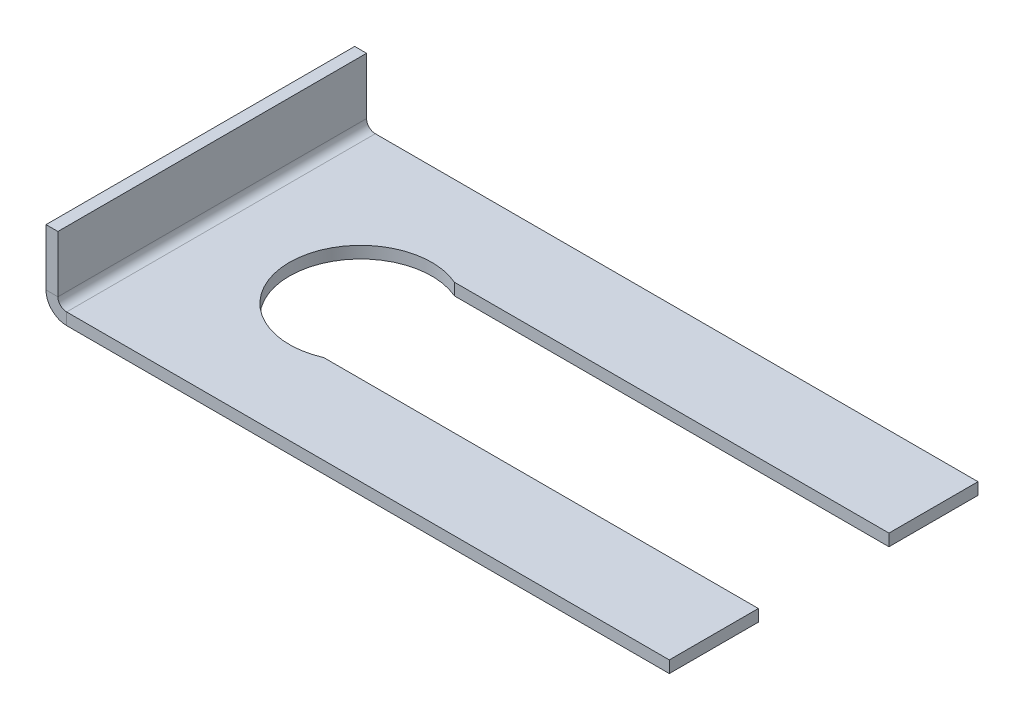
ISO-10303-21;
HEADER;
FILE_DESCRIPTION(('STEP AP214'),'2;1');
FILE_NAME('part.step','',(''),(''),'','','');
FILE_SCHEMA(('AUTOMOTIVE_DESIGN { 1 0 10303 214 1 1 1 1 }'));
ENDSEC;
DATA;
#1=APPLICATION_CONTEXT('core data for automotive mechanical design processes');
#2=APPLICATION_PROTOCOL_DEFINITION('international standard','automotive_design',2000,#1);
#3=PRODUCT_CONTEXT('',#1,'mechanical');
#4=PRODUCT('Part','Part','',(#3));
#5=PRODUCT_RELATED_PRODUCT_CATEGORY('part','',(#4));
#6=PRODUCT_DEFINITION_FORMATION('','',#4);
#7=PRODUCT_DEFINITION_CONTEXT('part definition',#1,'design');
#8=PRODUCT_DEFINITION('design','',#6,#7);
#9=PRODUCT_DEFINITION_SHAPE('','',#8);
#10=(LENGTH_UNIT() NAMED_UNIT(*) SI_UNIT(.MILLI.,.METRE.));
#11=(NAMED_UNIT(*) PLANE_ANGLE_UNIT() SI_UNIT($,.RADIAN.));
#12=(NAMED_UNIT(*) SI_UNIT($,.STERADIAN.) SOLID_ANGLE_UNIT());
#13=UNCERTAINTY_MEASURE_WITH_UNIT(LENGTH_MEASURE(1.E-05),#10,'distance_accuracy_value','');
#14=(GEOMETRIC_REPRESENTATION_CONTEXT(3) GLOBAL_UNCERTAINTY_ASSIGNED_CONTEXT((#13)) GLOBAL_UNIT_ASSIGNED_CONTEXT((#10,
#11,#12)) REPRESENTATION_CONTEXT('',''));
#15=CARTESIAN_POINT('',(0.,0.,0.));
#16=DIRECTION('',(0.,0.,1.));
#17=DIRECTION('',(1.,0.,0.));
#18=AXIS2_PLACEMENT_3D('',#15,#16,#17);
#19=CARTESIAN_POINT('',(-26.25,-1.,13.));
#20=DIRECTION('',(0.,0.,1.));
#21=DIRECTION('',(1.,0.,0.));
#22=AXIS2_PLACEMENT_3D('',#19,#20,#21);
#23=PLANE('',#22);
#24=DIRECTION('',(1.,0.,0.));
#25=VECTOR('',#24,1.);
#26=CARTESIAN_POINT('',(-26.25,0.,13.));
#27=LINE('',#26,#25);
#28=CARTESIAN_POINT('',(-24.5134,0.,13.));
#29=VERTEX_POINT('',#28);
#30=CARTESIAN_POINT('',(26.25,0.,13.));
#31=VERTEX_POINT('',#30);
#32=EDGE_CURVE('E176',#29,#31,#27,.T.);
#33=ORIENTED_EDGE('',*,*,#32,.F.);
#34=DIRECTION('',(0.,-1.,0.));
#35=VECTOR('',#34,1.);
#36=CARTESIAN_POINT('',(-24.5134,0.,13.));
#37=LINE('',#36,#35);
#38=CARTESIAN_POINT('',(-24.5134,-1.,13.));
#39=VERTEX_POINT('',#38);
#40=EDGE_CURVE('E242',#29,#39,#37,.T.);
#41=ORIENTED_EDGE('',*,*,#40,.T.);
#42=DIRECTION('',(1.,0.,0.));
#43=VECTOR('',#42,1.);
#44=CARTESIAN_POINT('',(-26.25,-1.,13.));
#45=LINE('',#44,#43);
#46=CARTESIAN_POINT('',(26.25,-1.,13.));
#47=VERTEX_POINT('',#46);
#48=EDGE_CURVE('E162',#39,#47,#45,.T.);
#49=ORIENTED_EDGE('',*,*,#48,.T.);
#50=DIRECTION('',(0.,1.,0.));
#51=VECTOR('',#50,1.);
#52=CARTESIAN_POINT('',(26.25,-1.,13.));
#53=LINE('',#52,#51);
#54=EDGE_CURVE('E196',#47,#31,#53,.T.);
#55=ORIENTED_EDGE('',*,*,#54,.T.);
#56=EDGE_LOOP('',(#33,#41,#49,#55));
#57=FACE_BOUND('',#56,.T.);
#58=ADVANCED_FACE('F64',(#57),#23,.T.);
#59=CARTESIAN_POINT('',(-12.75,-1.,0.));
#60=DIRECTION('',(0.,1.,0.));
#61=DIRECTION('',(0.,0.,1.));
#62=AXIS2_PLACEMENT_3D('',#59,#60,#61);
#63=PLANE('',#62);
#64=DIRECTION('',(0.,0.,1.));
#65=VECTOR('',#64,1.);
#66=CARTESIAN_POINT('',(-24.5134,-1.,13.));
#67=LINE('',#66,#65);
#68=CARTESIAN_POINT('',(-24.5134,-1.,-13.));
#69=VERTEX_POINT('',#68);
#70=EDGE_CURVE('E284',#39,#69,#67,.F.);
#71=ORIENTED_EDGE('',*,*,#70,.T.);
#72=DIRECTION('',(-1.,0.,0.));
#73=VECTOR('',#72,1.);
#74=CARTESIAN_POINT('',(-26.25,-1.,-13.));
#75=LINE('',#74,#73);
#76=CARTESIAN_POINT('',(26.25,-1.,-13.));
#77=VERTEX_POINT('',#76);
#78=EDGE_CURVE('E280',#77,#69,#75,.T.);
#79=ORIENTED_EDGE('',*,*,#78,.F.);
#80=DIRECTION('',(0.,0.,-1.));
#81=VECTOR('',#80,1.);
#82=CARTESIAN_POINT('',(26.25,-1.,-5.5));
#83=LINE('',#82,#81);
#84=CARTESIAN_POINT('',(26.25,-1.,-5.5));
#85=VERTEX_POINT('',#84);
#86=EDGE_CURVE('E191',#85,#77,#83,.T.);
#87=ORIENTED_EDGE('',*,*,#86,.F.);
#88=DIRECTION('',(1.,0.,0.));
#89=VECTOR('',#88,1.);
#90=CARTESIAN_POINT('',(-10.3520842383436,-1.,-5.5));
#91=LINE('',#90,#89);
#92=CARTESIAN_POINT('',(-10.3520842383436,-1.,-5.5));
#93=VERTEX_POINT('',#92);
#94=EDGE_CURVE('E154',#93,#85,#91,.T.);
#95=ORIENTED_EDGE('',*,*,#94,.F.);
#96=CARTESIAN_POINT('',(-12.75,-1.,0.));
#97=DIRECTION('',(0.,-1.,0.));
#98=DIRECTION('',(0.,0.,1.));
#99=AXIS2_PLACEMENT_3D('',#96,#97,#98);
#100=CIRCLE('',#99,6.);
#101=CARTESIAN_POINT('',(-10.3520842383436,-1.,5.5));
#102=VERTEX_POINT('',#101);
#103=EDGE_CURVE('E136',#102,#93,#100,.T.);
#104=ORIENTED_EDGE('',*,*,#103,.F.);
#105=DIRECTION('',(-1.,0.,0.));
#106=VECTOR('',#105,1.);
#107=CARTESIAN_POINT('',(-10.3520842383436,-1.,5.5));
#108=LINE('',#107,#106);
#109=CARTESIAN_POINT('',(26.25,-1.,5.5));
#110=VERTEX_POINT('',#109);
#111=EDGE_CURVE('E152',#110,#102,#108,.T.);
#112=ORIENTED_EDGE('',*,*,#111,.F.);
#113=DIRECTION('',(0.,0.,-1.));
#114=VECTOR('',#113,1.);
#115=CARTESIAN_POINT('',(26.25,-1.,13.));
#116=LINE('',#115,#114);
#117=EDGE_CURVE('E159',#47,#110,#116,.T.);
#118=ORIENTED_EDGE('',*,*,#117,.F.);
#119=ORIENTED_EDGE('',*,*,#48,.F.);
#120=EDGE_LOOP('',(#71,#79,#87,#95,#104,#112,#118,#119));
#121=FACE_BOUND('',#120,.T.);
#122=ADVANCED_FACE('F150',(#121),#63,.F.);
#123=CARTESIAN_POINT('',(-12.75,0.,0.));
#124=DIRECTION('',(0.,1.,0.));
#125=DIRECTION('',(0.,0.,1.));
#126=AXIS2_PLACEMENT_3D('',#123,#124,#125);
#127=PLANE('',#126);
#128=DIRECTION('',(-1.,0.,0.));
#129=VECTOR('',#128,1.);
#130=CARTESIAN_POINT('',(-26.25,0.,-13.));
#131=LINE('',#130,#129);
#132=CARTESIAN_POINT('',(26.25,0.,-13.));
#133=VERTEX_POINT('',#132);
#134=CARTESIAN_POINT('',(-24.5134,0.,-13.));
#135=VERTEX_POINT('',#134);
#136=EDGE_CURVE('E172',#133,#135,#131,.T.);
#137=ORIENTED_EDGE('',*,*,#136,.T.);
#138=DIRECTION('',(0.,0.,1.));
#139=VECTOR('',#138,1.);
#140=CARTESIAN_POINT('',(-24.5134,0.,13.));
#141=LINE('',#140,#139);
#142=EDGE_CURVE('E82',#29,#135,#141,.F.);
#143=ORIENTED_EDGE('',*,*,#142,.F.);
#144=ORIENTED_EDGE('',*,*,#32,.T.);
#145=DIRECTION('',(0.,0.,-1.));
#146=VECTOR('',#145,1.);
#147=CARTESIAN_POINT('',(26.25,0.,13.));
#148=LINE('',#147,#146);
#149=CARTESIAN_POINT('',(26.25,0.,5.5));
#150=VERTEX_POINT('',#149);
#151=EDGE_CURVE('E179',#31,#150,#148,.T.);
#152=ORIENTED_EDGE('',*,*,#151,.T.);
#153=DIRECTION('',(-1.,0.,0.));
#154=VECTOR('',#153,1.);
#155=CARTESIAN_POINT('',(-10.3520842383436,0.,5.5));
#156=LINE('',#155,#154);
#157=CARTESIAN_POINT('',(-10.3520842383436,0.,5.5));
#158=VERTEX_POINT('',#157);
#159=EDGE_CURVE('E183',#150,#158,#156,.T.);
#160=ORIENTED_EDGE('',*,*,#159,.T.);
#161=CARTESIAN_POINT('',(-12.75,0.,0.));
#162=DIRECTION('',(0.,-1.,0.));
#163=DIRECTION('',(0.,0.,1.));
#164=AXIS2_PLACEMENT_3D('',#161,#162,#163);
#165=CIRCLE('',#164,6.);
#166=CARTESIAN_POINT('',(-10.3520842383436,0.,-5.5));
#167=VERTEX_POINT('',#166);
#168=EDGE_CURVE('E139',#158,#167,#165,.T.);
#169=ORIENTED_EDGE('',*,*,#168,.T.);
#170=DIRECTION('',(1.,0.,0.));
#171=VECTOR('',#170,1.);
#172=CARTESIAN_POINT('',(-10.3520842383436,0.,-5.5));
#173=LINE('',#172,#171);
#174=CARTESIAN_POINT('',(26.25,0.,-5.5));
#175=VERTEX_POINT('',#174);
#176=EDGE_CURVE('E188',#167,#175,#173,.T.);
#177=ORIENTED_EDGE('',*,*,#176,.T.);
#178=DIRECTION('',(0.,0.,-1.));
#179=VECTOR('',#178,1.);
#180=CARTESIAN_POINT('',(26.25,0.,-5.5));
#181=LINE('',#180,#179);
#182=EDGE_CURVE('E168',#175,#133,#181,.T.);
#183=ORIENTED_EDGE('',*,*,#182,.T.);
#184=EDGE_LOOP('',(#137,#143,#144,#152,#160,#169,#177,#183));
#185=FACE_BOUND('',#184,.T.);
#186=ADVANCED_FACE('F207',(#185),#127,.T.);
#187=CARTESIAN_POINT('',(26.25,-1.,-5.5));
#188=DIRECTION('',(1.,0.,0.));
#189=DIRECTION('',(0.,0.,-1.));
#190=AXIS2_PLACEMENT_3D('',#187,#188,#189);
#191=PLANE('',#190);
#192=ORIENTED_EDGE('',*,*,#182,.F.);
#193=DIRECTION('',(0.,1.,0.));
#194=VECTOR('',#193,1.);
#195=CARTESIAN_POINT('',(26.25,-1.,-5.5));
#196=LINE('',#195,#194);
#197=EDGE_CURVE('E13',#85,#175,#196,.T.);
#198=ORIENTED_EDGE('',*,*,#197,.F.);
#199=ORIENTED_EDGE('',*,*,#86,.T.);
#200=DIRECTION('',(0.,1.,0.));
#201=VECTOR('',#200,1.);
#202=CARTESIAN_POINT('',(26.25,-1.,-13.));
#203=LINE('',#202,#201);
#204=EDGE_CURVE('E68',#77,#133,#203,.T.);
#205=ORIENTED_EDGE('',*,*,#204,.T.);
#206=EDGE_LOOP('',(#192,#198,#199,#205));
#207=FACE_BOUND('',#206,.T.);
#208=ADVANCED_FACE('F66',(#207),#191,.T.);
#209=CARTESIAN_POINT('',(-10.3520842383436,-1.,-5.5));
#210=DIRECTION('',(0.,0.,1.));
#211=DIRECTION('',(1.,0.,0.));
#212=AXIS2_PLACEMENT_3D('',#209,#210,#211);
#213=PLANE('',#212);
#214=ORIENTED_EDGE('',*,*,#176,.F.);
#215=DIRECTION('',(0.,1.,0.));
#216=VECTOR('',#215,1.);
#217=CARTESIAN_POINT('',(-10.3520842383436,-1.,-5.5));
#218=LINE('',#217,#216);
#219=EDGE_CURVE('E74',#93,#167,#218,.T.);
#220=ORIENTED_EDGE('',*,*,#219,.F.);
#221=ORIENTED_EDGE('',*,*,#94,.T.);
#222=ORIENTED_EDGE('',*,*,#197,.T.);
#223=EDGE_LOOP('',(#214,#220,#221,#222));
#224=FACE_BOUND('',#223,.T.);
#225=ADVANCED_FACE('F208',(#224),#213,.T.);
#226=CARTESIAN_POINT('',(-12.75,-1.,0.));
#227=DIRECTION('',(0.,1.,0.));
#228=DIRECTION('',(0.,0.,1.));
#229=AXIS2_PLACEMENT_3D('',#226,#227,#228);
#230=CYLINDRICAL_SURFACE('',#229,6.);
#231=ORIENTED_EDGE('',*,*,#168,.F.);
#232=DIRECTION('',(0.,1.,0.));
#233=VECTOR('',#232,1.);
#234=CARTESIAN_POINT('',(-10.3520842383436,-1.,5.5));
#235=LINE('',#234,#233);
#236=EDGE_CURVE('E133',#102,#158,#235,.T.);
#237=ORIENTED_EDGE('',*,*,#236,.F.);
#238=ORIENTED_EDGE('',*,*,#103,.T.);
#239=ORIENTED_EDGE('',*,*,#219,.T.);
#240=EDGE_LOOP('',(#231,#237,#238,#239));
#241=FACE_BOUND('',#240,.T.);
#242=ADVANCED_FACE('F135',(#241),#230,.F.);
#243=CARTESIAN_POINT('',(-10.3520842383436,-1.,5.5));
#244=DIRECTION('',(0.,0.,-1.));
#245=DIRECTION('',(-1.,0.,0.));
#246=AXIS2_PLACEMENT_3D('',#243,#244,#245);
#247=PLANE('',#246);
#248=ORIENTED_EDGE('',*,*,#159,.F.);
#249=DIRECTION('',(0.,1.,0.));
#250=VECTOR('',#249,1.);
#251=CARTESIAN_POINT('',(26.25,-1.,5.5));
#252=LINE('',#251,#250);
#253=EDGE_CURVE('E145',#110,#150,#252,.T.);
#254=ORIENTED_EDGE('',*,*,#253,.F.);
#255=ORIENTED_EDGE('',*,*,#111,.T.);
#256=ORIENTED_EDGE('',*,*,#236,.T.);
#257=EDGE_LOOP('',(#248,#254,#255,#256));
#258=FACE_BOUND('',#257,.T.);
#259=ADVANCED_FACE('F157',(#258),#247,.T.);
#260=CARTESIAN_POINT('',(26.25,-1.,13.));
#261=DIRECTION('',(1.,0.,0.));
#262=DIRECTION('',(0.,0.,-1.));
#263=AXIS2_PLACEMENT_3D('',#260,#261,#262);
#264=PLANE('',#263);
#265=ORIENTED_EDGE('',*,*,#151,.F.);
#266=ORIENTED_EDGE('',*,*,#54,.F.);
#267=ORIENTED_EDGE('',*,*,#117,.T.);
#268=ORIENTED_EDGE('',*,*,#253,.T.);
#269=EDGE_LOOP('',(#265,#266,#267,#268));
#270=FACE_BOUND('',#269,.T.);
#271=ADVANCED_FACE('F224',(#270),#264,.T.);
#272=CARTESIAN_POINT('',(-26.25,-1.,-13.));
#273=DIRECTION('',(0.,0.,-1.));
#274=DIRECTION('',(-1.,0.,0.));
#275=AXIS2_PLACEMENT_3D('',#272,#273,#274);
#276=PLANE('',#275);
#277=DIRECTION('',(0.,-1.,0.));
#278=VECTOR('',#277,1.);
#279=CARTESIAN_POINT('',(-24.5134,0.,-13.));
#280=LINE('',#279,#278);
#281=EDGE_CURVE('E173',#135,#69,#280,.T.);
#282=ORIENTED_EDGE('',*,*,#281,.F.);
#283=ORIENTED_EDGE('',*,*,#136,.F.);
#284=ORIENTED_EDGE('',*,*,#204,.F.);
#285=ORIENTED_EDGE('',*,*,#78,.T.);
#286=EDGE_LOOP('',(#282,#283,#284,#285));
#287=FACE_BOUND('',#286,.T.);
#288=ADVANCED_FACE('F204',(#287),#276,.T.);
#289=CARTESIAN_POINT('',(-24.5134,0.7366,-13.));
#290=DIRECTION('',(0.,0.,-1.));
#291=DIRECTION('',(-1.,0.,0.));
#292=AXIS2_PLACEMENT_3D('',#289,#290,#291);
#293=PLANE('',#292);
#294=DIRECTION('',(1.,0.,0.));
#295=VECTOR('',#294,1.);
#296=CARTESIAN_POINT('',(-26.25,0.736599999999993,-13.));
#297=LINE('',#296,#295);
#298=CARTESIAN_POINT('',(-25.25,0.736599999999997,-13.));
#299=VERTEX_POINT('',#298);
#300=CARTESIAN_POINT('',(-26.25,0.736599999999993,-13.));
#301=VERTEX_POINT('',#300);
#302=EDGE_CURVE('E297',#299,#301,#297,.F.);
#303=ORIENTED_EDGE('',*,*,#302,.F.);
#304=CARTESIAN_POINT('',(-24.5134,0.7366,-13.));
#305=DIRECTION('',(0.,0.,1.));
#306=DIRECTION('',(1.,0.,0.));
#307=AXIS2_PLACEMENT_3D('',#304,#305,#306);
#308=CIRCLE('',#307,0.7366);
#309=EDGE_CURVE('E269',#135,#299,#308,.F.);
#310=ORIENTED_EDGE('',*,*,#309,.F.);
#311=ORIENTED_EDGE('',*,*,#281,.T.);
#312=CARTESIAN_POINT('',(-24.5134,0.7366,-13.));
#313=DIRECTION('',(0.,0.,1.));
#314=DIRECTION('',(1.,0.,0.));
#315=AXIS2_PLACEMENT_3D('',#312,#313,#314);
#316=CIRCLE('',#315,1.7366);
#317=EDGE_CURVE('E255',#69,#301,#316,.F.);
#318=ORIENTED_EDGE('',*,*,#317,.T.);
#319=EDGE_LOOP('',(#303,#310,#311,#318));
#320=FACE_BOUND('',#319,.T.);
#321=ADVANCED_FACE('F227',(#320),#293,.T.);
#322=CARTESIAN_POINT('',(-24.5134,0.7366,13.));
#323=DIRECTION('',(0.,0.,-1.));
#324=DIRECTION('',(-1.,0.,0.));
#325=AXIS2_PLACEMENT_3D('',#322,#323,#324);
#326=PLANE('',#325);
#327=CARTESIAN_POINT('',(-24.5134,0.7366,13.));
#328=DIRECTION('',(0.,0.,1.));
#329=DIRECTION('',(1.,0.,0.));
#330=AXIS2_PLACEMENT_3D('',#327,#328,#329);
#331=CIRCLE('',#330,0.7366);
#332=CARTESIAN_POINT('',(-25.25,0.736599999999997,13.));
#333=VERTEX_POINT('',#332);
#334=EDGE_CURVE('E250',#333,#29,#331,.T.);
#335=ORIENTED_EDGE('',*,*,#334,.F.);
#336=DIRECTION('',(1.,0.,0.));
#337=VECTOR('',#336,1.);
#338=CARTESIAN_POINT('',(-25.25,0.736599999999997,13.));
#339=LINE('',#338,#337);
#340=CARTESIAN_POINT('',(-26.25,0.736599999999993,13.));
#341=VERTEX_POINT('',#340);
#342=EDGE_CURVE('E322',#333,#341,#339,.F.);
#343=ORIENTED_EDGE('',*,*,#342,.T.);
#344=CARTESIAN_POINT('',(-24.5134,0.7366,13.));
#345=DIRECTION('',(0.,0.,1.));
#346=DIRECTION('',(1.,0.,0.));
#347=AXIS2_PLACEMENT_3D('',#344,#345,#346);
#348=CIRCLE('',#347,1.7366);
#349=EDGE_CURVE('E253',#341,#39,#348,.T.);
#350=ORIENTED_EDGE('',*,*,#349,.T.);
#351=ORIENTED_EDGE('',*,*,#40,.F.);
#352=EDGE_LOOP('',(#335,#343,#350,#351));
#353=FACE_BOUND('',#352,.T.);
#354=ADVANCED_FACE('F232',(#353),#326,.F.);
#355=CARTESIAN_POINT('',(-24.5134,0.7366,13.));
#356=DIRECTION('',(0.,0.,1.));
#357=DIRECTION('',(-1.,0.,0.));
#358=AXIS2_PLACEMENT_3D('',#355,#356,#357);
#359=CYLINDRICAL_SURFACE('',#358,1.7366);
#360=ORIENTED_EDGE('',*,*,#70,.F.);
#361=ORIENTED_EDGE('',*,*,#349,.F.);
#362=DIRECTION('',(0.,0.,1.));
#363=VECTOR('',#362,1.);
#364=CARTESIAN_POINT('',(-26.25,0.736599999999993,-13.));
#365=LINE('',#364,#363);
#366=EDGE_CURVE('E319',#341,#301,#365,.F.);
#367=ORIENTED_EDGE('',*,*,#366,.T.);
#368=ORIENTED_EDGE('',*,*,#317,.F.);
#369=EDGE_LOOP('',(#360,#361,#367,#368));
#370=FACE_BOUND('',#369,.T.);
#371=ADVANCED_FACE('F316',(#370),#359,.T.);
#372=CARTESIAN_POINT('',(-24.5134,0.7366,13.));
#373=DIRECTION('',(0.,0.,1.));
#374=DIRECTION('',(-1.,0.,0.));
#375=AXIS2_PLACEMENT_3D('',#372,#373,#374);
#376=CYLINDRICAL_SURFACE('',#375,0.7366);
#377=ORIENTED_EDGE('',*,*,#142,.T.);
#378=ORIENTED_EDGE('',*,*,#309,.T.);
#379=DIRECTION('',(0.,0.,1.));
#380=VECTOR('',#379,1.);
#381=CARTESIAN_POINT('',(-25.25,0.736599999999997,-13.));
#382=LINE('',#381,#380);
#383=EDGE_CURVE('E263',#299,#333,#382,.T.);
#384=ORIENTED_EDGE('',*,*,#383,.T.);
#385=ORIENTED_EDGE('',*,*,#334,.T.);
#386=EDGE_LOOP('',(#377,#378,#384,#385));
#387=FACE_BOUND('',#386,.T.);
#388=ADVANCED_FACE('F259',(#387),#376,.F.);
#389=CARTESIAN_POINT('',(-26.25,0.,-13.));
#390=DIRECTION('',(0.,0.,1.));
#391=DIRECTION('',(1.,0.,0.));
#392=AXIS2_PLACEMENT_3D('',#389,#390,#391);
#393=PLANE('',#392);
#394=ORIENTED_EDGE('',*,*,#302,.T.);
#395=DIRECTION('',(0.,-1.,0.));
#396=VECTOR('',#395,1.);
#397=CARTESIAN_POINT('',(-26.25,-1.0284382587206E-13,-13.));
#398=LINE('',#397,#396);
#399=CARTESIAN_POINT('',(-26.25,5.5,-13.));
#400=VERTEX_POINT('',#399);
#401=EDGE_CURVE('E332',#400,#301,#398,.T.);
#402=ORIENTED_EDGE('',*,*,#401,.F.);
#403=DIRECTION('',(1.,0.,0.));
#404=VECTOR('',#403,1.);
#405=CARTESIAN_POINT('',(-26.25,5.5,-13.));
#406=LINE('',#405,#404);
#407=CARTESIAN_POINT('',(-25.25,5.5,-13.));
#408=VERTEX_POINT('',#407);
#409=EDGE_CURVE('E272',#400,#408,#406,.T.);
#410=ORIENTED_EDGE('',*,*,#409,.T.);
#411=DIRECTION('',(0.,1.,0.));
#412=VECTOR('',#411,1.);
#413=CARTESIAN_POINT('',(-25.25,0.,-13.));
#414=LINE('',#413,#412);
#415=EDGE_CURVE('E334',#408,#299,#414,.F.);
#416=ORIENTED_EDGE('',*,*,#415,.T.);
#417=EDGE_LOOP('',(#394,#402,#410,#416));
#418=FACE_BOUND('',#417,.T.);
#419=ADVANCED_FACE('F368',(#418),#393,.F.);
#420=CARTESIAN_POINT('',(-26.25,5.5,13.));
#421=DIRECTION('',(0.,0.,-1.));
#422=DIRECTION('',(-1.,0.,0.));
#423=AXIS2_PLACEMENT_3D('',#420,#421,#422);
#424=PLANE('',#423);
#425=ORIENTED_EDGE('',*,*,#342,.F.);
#426=DIRECTION('',(0.,-1.,0.));
#427=VECTOR('',#426,1.);
#428=CARTESIAN_POINT('',(-25.25,5.5,13.));
#429=LINE('',#428,#427);
#430=CARTESIAN_POINT('',(-25.25,5.5,13.));
#431=VERTEX_POINT('',#430);
#432=EDGE_CURVE('E348',#333,#431,#429,.F.);
#433=ORIENTED_EDGE('',*,*,#432,.T.);
#434=DIRECTION('',(1.,0.,0.));
#435=VECTOR('',#434,1.);
#436=CARTESIAN_POINT('',(-26.25,5.5,13.));
#437=LINE('',#436,#435);
#438=CARTESIAN_POINT('',(-26.25,5.5,13.));
#439=VERTEX_POINT('',#438);
#440=EDGE_CURVE('E265',#439,#431,#437,.T.);
#441=ORIENTED_EDGE('',*,*,#440,.F.);
#442=DIRECTION('',(0.,1.,0.));
#443=VECTOR('',#442,1.);
#444=CARTESIAN_POINT('',(-26.25,-1.0284382587206E-13,13.));
#445=LINE('',#444,#443);
#446=EDGE_CURVE('E329',#341,#439,#445,.T.);
#447=ORIENTED_EDGE('',*,*,#446,.F.);
#448=EDGE_LOOP('',(#425,#433,#441,#447));
#449=FACE_BOUND('',#448,.T.);
#450=ADVANCED_FACE('F336',(#449),#424,.F.);
#451=CARTESIAN_POINT('',(-26.25,-1.0284382587206E-13,0.));
#452=DIRECTION('',(1.,0.,0.));
#453=DIRECTION('',(0.,1.,0.));
#454=AXIS2_PLACEMENT_3D('',#451,#452,#453);
#455=PLANE('',#454);
#456=ORIENTED_EDGE('',*,*,#366,.F.);
#457=ORIENTED_EDGE('',*,*,#446,.T.);
#458=DIRECTION('',(0.,0.,-1.));
#459=VECTOR('',#458,1.);
#460=CARTESIAN_POINT('',(-26.25,5.5,0.));
#461=LINE('',#460,#459);
#462=EDGE_CURVE('E305',#439,#400,#461,.T.);
#463=ORIENTED_EDGE('',*,*,#462,.T.);
#464=ORIENTED_EDGE('',*,*,#401,.T.);
#465=EDGE_LOOP('',(#456,#457,#463,#464));
#466=FACE_BOUND('',#465,.T.);
#467=ADVANCED_FACE('F328',(#466),#455,.F.);
#468=CARTESIAN_POINT('',(-25.25,0.,0.));
#469=DIRECTION('',(1.,0.,0.));
#470=DIRECTION('',(0.,1.,0.));
#471=AXIS2_PLACEMENT_3D('',#468,#469,#470);
#472=PLANE('',#471);
#473=ORIENTED_EDGE('',*,*,#432,.F.);
#474=ORIENTED_EDGE('',*,*,#383,.F.);
#475=ORIENTED_EDGE('',*,*,#415,.F.);
#476=DIRECTION('',(0.,0.,1.));
#477=VECTOR('',#476,1.);
#478=CARTESIAN_POINT('',(-25.25,5.5,-13.));
#479=LINE('',#478,#477);
#480=EDGE_CURVE('E342',#431,#408,#479,.F.);
#481=ORIENTED_EDGE('',*,*,#480,.F.);
#482=EDGE_LOOP('',(#473,#474,#475,#481));
#483=FACE_BOUND('',#482,.T.);
#484=ADVANCED_FACE('F364',(#483),#472,.T.);
#485=CARTESIAN_POINT('',(-26.25,5.5,-13.));
#486=DIRECTION('',(0.,-1.,0.));
#487=DIRECTION('',(1.,0.,0.));
#488=AXIS2_PLACEMENT_3D('',#485,#486,#487);
#489=PLANE('',#488);
#490=ORIENTED_EDGE('',*,*,#480,.T.);
#491=ORIENTED_EDGE('',*,*,#409,.F.);
#492=ORIENTED_EDGE('',*,*,#462,.F.);
#493=ORIENTED_EDGE('',*,*,#440,.T.);
#494=EDGE_LOOP('',(#490,#491,#492,#493));
#495=FACE_BOUND('',#494,.T.);
#496=ADVANCED_FACE('F371',(#495),#489,.F.);
#497=CLOSED_SHELL('',(#58,#122,#186,#208,#225,#242,#259,#271,#288,#321,#354,#371,#388,#419,#450,
#467,#484,#496));
#498=MANIFOLD_SOLID_BREP('B2',#497);
#499=ADVANCED_BREP_SHAPE_REPRESENTATION('',(#18,#498),#14);
#500=SHAPE_DEFINITION_REPRESENTATION(#9,#499);
ENDSEC;
END-ISO-10303-21;
